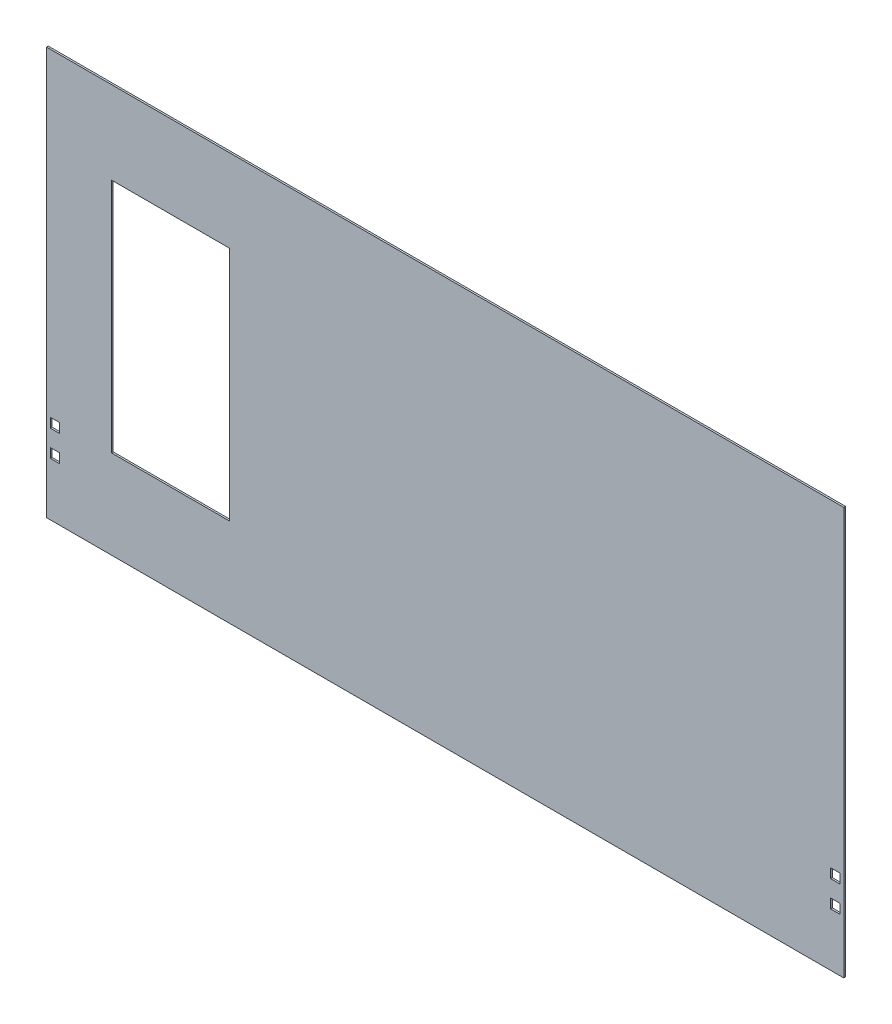
ISO-10303-21;
HEADER;
FILE_DESCRIPTION(('STEP AP214'),'2;1');
FILE_NAME('part.step','',(''),(''),'','','');
FILE_SCHEMA(('AUTOMOTIVE_DESIGN { 1 0 10303 214 1 1 1 1 }'));
ENDSEC;
DATA;
#1=APPLICATION_CONTEXT('core data for automotive mechanical design processes');
#2=APPLICATION_PROTOCOL_DEFINITION('international standard','automotive_design',2000,#1);
#3=PRODUCT_CONTEXT('',#1,'mechanical');
#4=PRODUCT('Part','Part','',(#3));
#5=PRODUCT_RELATED_PRODUCT_CATEGORY('part','',(#4));
#6=PRODUCT_DEFINITION_FORMATION('','',#4);
#7=PRODUCT_DEFINITION_CONTEXT('part definition',#1,'design');
#8=PRODUCT_DEFINITION('design','',#6,#7);
#9=PRODUCT_DEFINITION_SHAPE('','',#8);
#10=(LENGTH_UNIT() NAMED_UNIT(*) SI_UNIT(.MILLI.,.METRE.));
#11=(NAMED_UNIT(*) PLANE_ANGLE_UNIT() SI_UNIT($,.RADIAN.));
#12=(NAMED_UNIT(*) SI_UNIT($,.STERADIAN.) SOLID_ANGLE_UNIT());
#13=UNCERTAINTY_MEASURE_WITH_UNIT(LENGTH_MEASURE(1.E-05),#10,'distance_accuracy_value','');
#14=(GEOMETRIC_REPRESENTATION_CONTEXT(3) GLOBAL_UNCERTAINTY_ASSIGNED_CONTEXT((#13)) GLOBAL_UNIT_ASSIGNED_CONTEXT((#10,
#11,#12)) REPRESENTATION_CONTEXT('',''));
#15=CARTESIAN_POINT('',(0.,0.,0.));
#16=DIRECTION('',(0.,0.,1.));
#17=DIRECTION('',(1.,0.,0.));
#18=AXIS2_PLACEMENT_3D('',#15,#16,#17);
#19=CARTESIAN_POINT('',(0.,0.,-3.));
#20=DIRECTION('',(0.,0.,-1.));
#21=DIRECTION('',(-1.,0.,0.));
#22=AXIS2_PLACEMENT_3D('',#19,#20,#21);
#23=PLANE('',#22);
#24=DIRECTION('',(0.,-1.,0.));
#25=VECTOR('',#24,1.);
#26=CARTESIAN_POINT('',(-565.000000000001,260.,-3.));
#27=LINE('',#26,#25);
#28=CARTESIAN_POINT('',(-565.000000000001,260.,-3.));
#29=VERTEX_POINT('',#28);
#30=CARTESIAN_POINT('',(-565.000000000001,-140.,-3.));
#31=VERTEX_POINT('',#30);
#32=EDGE_CURVE('E398',#29,#31,#27,.T.);
#33=ORIENTED_EDGE('',*,*,#32,.T.);
#34=DIRECTION('',(1.,0.,0.));
#35=VECTOR('',#34,1.);
#36=CARTESIAN_POINT('',(-565.000000000001,-140.,-3.));
#37=LINE('',#36,#35);
#38=CARTESIAN_POINT('',(-365.000000000001,-140.,-3.));
#39=VERTEX_POINT('',#38);
#40=EDGE_CURVE('E540',#31,#39,#37,.T.);
#41=ORIENTED_EDGE('',*,*,#40,.T.);
#42=DIRECTION('',(0.,1.,0.));
#43=VECTOR('',#42,1.);
#44=CARTESIAN_POINT('',(-365.000000000001,260.,-3.));
#45=LINE('',#44,#43);
#46=CARTESIAN_POINT('',(-365.000000000001,260.,-3.));
#47=VERTEX_POINT('',#46);
#48=EDGE_CURVE('E502',#39,#47,#45,.T.);
#49=ORIENTED_EDGE('',*,*,#48,.T.);
#50=DIRECTION('',(-1.,0.,0.));
#51=VECTOR('',#50,1.);
#52=CARTESIAN_POINT('',(-565.000000000001,260.,-3.));
#53=LINE('',#52,#51);
#54=EDGE_CURVE('E630',#47,#29,#53,.T.);
#55=ORIENTED_EDGE('',*,*,#54,.T.);
#56=EDGE_LOOP('',(#33,#41,#49,#55));
#57=FACE_BOUND('',#56,.T.);
#58=DIRECTION('',(-1.,0.,0.));
#59=VECTOR('',#58,1.);
#60=CARTESIAN_POINT('',(-675.,-290.,-3.));
#61=LINE('',#60,#59);
#62=CARTESIAN_POINT('',(675.,-290.,-3.));
#63=VERTEX_POINT('',#62);
#64=CARTESIAN_POINT('',(-675.,-290.,-3.));
#65=VERTEX_POINT('',#64);
#66=EDGE_CURVE('E380',#63,#65,#61,.T.);
#67=ORIENTED_EDGE('',*,*,#66,.T.);
#68=DIRECTION('',(0.,-1.,0.));
#69=VECTOR('',#68,1.);
#70=CARTESIAN_POINT('',(-675.,-400.,-3.));
#71=LINE('',#70,#69);
#72=CARTESIAN_POINT('',(-675.,400.,-3.));
#73=VERTEX_POINT('',#72);
#74=EDGE_CURVE('E475',#73,#65,#71,.T.);
#75=ORIENTED_EDGE('',*,*,#74,.F.);
#76=DIRECTION('',(-1.,0.,0.));
#77=VECTOR('',#76,1.);
#78=CARTESIAN_POINT('',(-675.,400.,-3.));
#79=LINE('',#78,#77);
#80=CARTESIAN_POINT('',(675.,400.,-3.));
#81=VERTEX_POINT('',#80);
#82=EDGE_CURVE('E477',#81,#73,#79,.T.);
#83=ORIENTED_EDGE('',*,*,#82,.F.);
#84=DIRECTION('',(0.,1.,0.));
#85=VECTOR('',#84,1.);
#86=CARTESIAN_POINT('',(675.,-400.,-3.));
#87=LINE('',#86,#85);
#88=EDGE_CURVE('E384',#63,#81,#87,.T.);
#89=ORIENTED_EDGE('',*,*,#88,.F.);
#90=EDGE_LOOP('',(#67,#75,#83,#89));
#91=FACE_BOUND('',#90,.T.);
#92=DIRECTION('',(0.,-1.,0.));
#93=VECTOR('',#92,1.);
#94=CARTESIAN_POINT('',(668.5,-139.5,-3.));
#95=LINE('',#94,#93);
#96=CARTESIAN_POINT('',(668.5,-139.5,-3.));
#97=VERTEX_POINT('',#96);
#98=CARTESIAN_POINT('',(668.5,-155.5,-3.));
#99=VERTEX_POINT('',#98);
#100=EDGE_CURVE('E559',#97,#99,#95,.T.);
#101=ORIENTED_EDGE('',*,*,#100,.F.);
#102=DIRECTION('',(1.,0.,0.));
#103=VECTOR('',#102,1.);
#104=CARTESIAN_POINT('',(652.5,-139.5,-3.));
#105=LINE('',#104,#103);
#106=CARTESIAN_POINT('',(652.5,-139.5,-3.));
#107=VERTEX_POINT('',#106);
#108=EDGE_CURVE('E639',#107,#97,#105,.T.);
#109=ORIENTED_EDGE('',*,*,#108,.F.);
#110=DIRECTION('',(0.,1.,0.));
#111=VECTOR('',#110,1.);
#112=CARTESIAN_POINT('',(652.5,-155.5,-3.));
#113=LINE('',#112,#111);
#114=CARTESIAN_POINT('',(652.5,-155.5,-3.));
#115=VERTEX_POINT('',#114);
#116=EDGE_CURVE('E406',#115,#107,#113,.T.);
#117=ORIENTED_EDGE('',*,*,#116,.F.);
#118=DIRECTION('',(-1.,0.,0.));
#119=VECTOR('',#118,1.);
#120=CARTESIAN_POINT('',(668.5,-155.5,-3.));
#121=LINE('',#120,#119);
#122=EDGE_CURVE('E515',#99,#115,#121,.T.);
#123=ORIENTED_EDGE('',*,*,#122,.F.);
#124=EDGE_LOOP('',(#101,#109,#117,#123));
#125=FACE_BOUND('',#124,.T.);
#126=DIRECTION('',(0.,-1.,0.));
#127=VECTOR('',#126,1.);
#128=CARTESIAN_POINT('',(668.5,-183.850348269495,-3.));
#129=LINE('',#128,#127);
#130=CARTESIAN_POINT('',(668.5,-183.850348269495,-3.));
#131=VERTEX_POINT('',#130);
#132=CARTESIAN_POINT('',(668.5,-199.850348269495,-3.));
#133=VERTEX_POINT('',#132);
#134=EDGE_CURVE('E503',#131,#133,#129,.T.);
#135=ORIENTED_EDGE('',*,*,#134,.F.);
#136=DIRECTION('',(1.,0.,0.));
#137=VECTOR('',#136,1.);
#138=CARTESIAN_POINT('',(652.5,-183.850348269495,-3.));
#139=LINE('',#138,#137);
#140=CARTESIAN_POINT('',(652.5,-183.850348269495,-3.));
#141=VERTEX_POINT('',#140);
#142=EDGE_CURVE('E506',#141,#131,#139,.T.);
#143=ORIENTED_EDGE('',*,*,#142,.F.);
#144=DIRECTION('',(0.,1.,0.));
#145=VECTOR('',#144,1.);
#146=CARTESIAN_POINT('',(652.5,-199.850348269495,-3.));
#147=LINE('',#146,#145);
#148=CARTESIAN_POINT('',(652.5,-199.850348269495,-3.));
#149=VERTEX_POINT('',#148);
#150=EDGE_CURVE('E309',#149,#141,#147,.T.);
#151=ORIENTED_EDGE('',*,*,#150,.F.);
#152=DIRECTION('',(-1.,0.,0.));
#153=VECTOR('',#152,1.);
#154=CARTESIAN_POINT('',(668.5,-199.850348269495,-3.));
#155=LINE('',#154,#153);
#156=EDGE_CURVE('E497',#133,#149,#155,.T.);
#157=ORIENTED_EDGE('',*,*,#156,.F.);
#158=EDGE_LOOP('',(#135,#143,#151,#157));
#159=FACE_BOUND('',#158,.T.);
#160=DIRECTION('',(0.,1.,0.));
#161=VECTOR('',#160,1.);
#162=CARTESIAN_POINT('',(-652.5,-155.5,-3.));
#163=LINE('',#162,#161);
#164=CARTESIAN_POINT('',(-652.5,-155.5,-3.));
#165=VERTEX_POINT('',#164);
#166=CARTESIAN_POINT('',(-652.5,-139.5,-3.));
#167=VERTEX_POINT('',#166);
#168=EDGE_CURVE('E250',#165,#167,#163,.T.);
#169=ORIENTED_EDGE('',*,*,#168,.T.);
#170=DIRECTION('',(-1.,0.,0.));
#171=VECTOR('',#170,1.);
#172=CARTESIAN_POINT('',(-652.5,-139.5,-3.));
#173=LINE('',#172,#171);
#174=CARTESIAN_POINT('',(-668.5,-139.5,-3.));
#175=VERTEX_POINT('',#174);
#176=EDGE_CURVE('E62',#167,#175,#173,.T.);
#177=ORIENTED_EDGE('',*,*,#176,.T.);
#178=DIRECTION('',(0.,-1.,0.));
#179=VECTOR('',#178,1.);
#180=CARTESIAN_POINT('',(-668.5,-139.5,-3.));
#181=LINE('',#180,#179);
#182=CARTESIAN_POINT('',(-668.5,-155.5,-3.));
#183=VERTEX_POINT('',#182);
#184=EDGE_CURVE('E290',#175,#183,#181,.T.);
#185=ORIENTED_EDGE('',*,*,#184,.T.);
#186=DIRECTION('',(1.,0.,0.));
#187=VECTOR('',#186,1.);
#188=CARTESIAN_POINT('',(-668.5,-155.5,-3.));
#189=LINE('',#188,#187);
#190=EDGE_CURVE('E243',#183,#165,#189,.T.);
#191=ORIENTED_EDGE('',*,*,#190,.T.);
#192=EDGE_LOOP('',(#169,#177,#185,#191));
#193=FACE_BOUND('',#192,.T.);
#194=DIRECTION('',(0.,1.,0.));
#195=VECTOR('',#194,1.);
#196=CARTESIAN_POINT('',(-652.5,-199.850348269495,-3.));
#197=LINE('',#196,#195);
#198=CARTESIAN_POINT('',(-652.5,-199.850348269495,-3.));
#199=VERTEX_POINT('',#198);
#200=CARTESIAN_POINT('',(-652.5,-183.850348269495,-3.));
#201=VERTEX_POINT('',#200);
#202=EDGE_CURVE('E202',#199,#201,#197,.T.);
#203=ORIENTED_EDGE('',*,*,#202,.T.);
#204=DIRECTION('',(-1.,0.,0.));
#205=VECTOR('',#204,1.);
#206=CARTESIAN_POINT('',(-652.5,-183.850348269495,-3.));
#207=LINE('',#206,#205);
#208=CARTESIAN_POINT('',(-668.5,-183.850348269495,-3.));
#209=VERTEX_POINT('',#208);
#210=EDGE_CURVE('E54',#201,#209,#207,.T.);
#211=ORIENTED_EDGE('',*,*,#210,.T.);
#212=DIRECTION('',(0.,-1.,0.));
#213=VECTOR('',#212,1.);
#214=CARTESIAN_POINT('',(-668.5,-183.850348269495,-3.));
#215=LINE('',#214,#213);
#216=CARTESIAN_POINT('',(-668.5,-199.850348269495,-3.));
#217=VERTEX_POINT('',#216);
#218=EDGE_CURVE('E222',#209,#217,#215,.T.);
#219=ORIENTED_EDGE('',*,*,#218,.T.);
#220=DIRECTION('',(1.,0.,0.));
#221=VECTOR('',#220,1.);
#222=CARTESIAN_POINT('',(-668.5,-199.850348269495,-3.));
#223=LINE('',#222,#221);
#224=EDGE_CURVE('E215',#217,#199,#223,.T.);
#225=ORIENTED_EDGE('',*,*,#224,.T.);
#226=EDGE_LOOP('',(#203,#211,#219,#225));
#227=FACE_BOUND('',#226,.T.);
#228=ADVANCED_FACE('F39',(#57,#91,#125,#159,#193,#227),#23,.T.);
#229=CARTESIAN_POINT('',(0.,0.,0.));
#230=DIRECTION('',(0.,0.,-1.));
#231=DIRECTION('',(-1.,0.,0.));
#232=AXIS2_PLACEMENT_3D('',#229,#230,#231);
#233=PLANE('',#232);
#234=CARTESIAN_POINT('',(-652.5,-139.5,0.));
#235=CARTESIAN_POINT('',(-668.5,-139.5,0.));
#236=B_SPLINE_CURVE_WITH_KNOTS('',1,(#234,#235),.UNSPECIFIED.,.F.,.F.,(2,2),(0.,0.25),.UNSPECIFIED.);
#237=CARTESIAN_POINT('',(-652.5,-139.5,0.));
#238=VERTEX_POINT('',#237);
#239=CARTESIAN_POINT('',(-668.5,-139.5,0.));
#240=VERTEX_POINT('',#239);
#241=EDGE_CURVE('E275',#238,#240,#236,.T.);
#242=ORIENTED_EDGE('',*,*,#241,.F.);
#243=CARTESIAN_POINT('',(-652.5,-155.5,0.));
#244=CARTESIAN_POINT('',(-652.5,-139.5,0.));
#245=B_SPLINE_CURVE_WITH_KNOTS('',1,(#243,#244),.UNSPECIFIED.,.F.,.F.,(2,2),(0.75,1.),.UNSPECIFIED.);
#246=CARTESIAN_POINT('',(-652.5,-155.5,0.));
#247=VERTEX_POINT('',#246);
#248=EDGE_CURVE('E244',#247,#238,#245,.T.);
#249=ORIENTED_EDGE('',*,*,#248,.F.);
#250=CARTESIAN_POINT('',(-668.5,-155.5,0.));
#251=CARTESIAN_POINT('',(-652.5,-155.5,0.));
#252=B_SPLINE_CURVE_WITH_KNOTS('',1,(#250,#251),.UNSPECIFIED.,.F.,.F.,(2,2),(0.5,0.75),.UNSPECIFIED.);
#253=CARTESIAN_POINT('',(-668.5,-155.5,0.));
#254=VERTEX_POINT('',#253);
#255=EDGE_CURVE('E252',#254,#247,#252,.T.);
#256=ORIENTED_EDGE('',*,*,#255,.F.);
#257=CARTESIAN_POINT('',(-668.5,-139.5,0.));
#258=CARTESIAN_POINT('',(-668.5,-155.5,0.));
#259=B_SPLINE_CURVE_WITH_KNOTS('',1,(#257,#258),.UNSPECIFIED.,.F.,.F.,(2,2),(0.25,0.5),.UNSPECIFIED.);
#260=EDGE_CURVE('E268',#240,#254,#259,.T.);
#261=ORIENTED_EDGE('',*,*,#260,.F.);
#262=EDGE_LOOP('',(#242,#249,#256,#261));
#263=FACE_BOUND('',#262,.T.);
#264=CARTESIAN_POINT('',(652.5,-139.5,0.));
#265=CARTESIAN_POINT('',(668.5,-139.5,0.));
#266=B_SPLINE_CURVE_WITH_KNOTS('',1,(#264,#265),.UNSPECIFIED.,.F.,.F.,(2,2),(0.,0.25),.UNSPECIFIED.);
#267=CARTESIAN_POINT('',(652.5,-139.5,0.));
#268=VERTEX_POINT('',#267);
#269=CARTESIAN_POINT('',(668.5,-139.5,0.));
#270=VERTEX_POINT('',#269);
#271=EDGE_CURVE('E226',#268,#270,#266,.T.);
#272=ORIENTED_EDGE('',*,*,#271,.T.);
#273=CARTESIAN_POINT('',(668.5,-139.5,0.));
#274=CARTESIAN_POINT('',(668.5,-155.5,0.));
#275=B_SPLINE_CURVE_WITH_KNOTS('',1,(#273,#274),.UNSPECIFIED.,.F.,.F.,(2,2),(0.25,0.5),.UNSPECIFIED.);
#276=CARTESIAN_POINT('',(668.5,-155.5,0.));
#277=VERTEX_POINT('',#276);
#278=EDGE_CURVE('E414',#270,#277,#275,.T.);
#279=ORIENTED_EDGE('',*,*,#278,.T.);
#280=CARTESIAN_POINT('',(668.5,-155.5,0.));
#281=CARTESIAN_POINT('',(652.5,-155.5,0.));
#282=B_SPLINE_CURVE_WITH_KNOTS('',1,(#280,#281),.UNSPECIFIED.,.F.,.F.,(2,2),(0.5,0.75),.UNSPECIFIED.);
#283=CARTESIAN_POINT('',(652.5,-155.5,0.));
#284=VERTEX_POINT('',#283);
#285=EDGE_CURVE('E409',#277,#284,#282,.T.);
#286=ORIENTED_EDGE('',*,*,#285,.T.);
#287=CARTESIAN_POINT('',(652.5,-155.5,0.));
#288=CARTESIAN_POINT('',(652.5,-139.5,0.));
#289=B_SPLINE_CURVE_WITH_KNOTS('',1,(#287,#288),.UNSPECIFIED.,.F.,.F.,(2,2),(0.75,1.),.UNSPECIFIED.);
#290=EDGE_CURVE('E403',#284,#268,#289,.T.);
#291=ORIENTED_EDGE('',*,*,#290,.T.);
#292=EDGE_LOOP('',(#272,#279,#286,#291));
#293=FACE_BOUND('',#292,.T.);
#294=DIRECTION('',(1.,0.,0.));
#295=VECTOR('',#294,1.);
#296=CARTESIAN_POINT('',(-565.000000000001,-140.,0.));
#297=LINE('',#296,#295);
#298=CARTESIAN_POINT('',(-565.000000000001,-140.,0.));
#299=VERTEX_POINT('',#298);
#300=CARTESIAN_POINT('',(-365.000000000001,-140.,0.));
#301=VERTEX_POINT('',#300);
#302=EDGE_CURVE('E390',#299,#301,#297,.T.);
#303=ORIENTED_EDGE('',*,*,#302,.F.);
#304=DIRECTION('',(0.,-1.,0.));
#305=VECTOR('',#304,1.);
#306=CARTESIAN_POINT('',(-565.000000000001,260.,0.));
#307=LINE('',#306,#305);
#308=CARTESIAN_POINT('',(-565.000000000001,260.,0.));
#309=VERTEX_POINT('',#308);
#310=EDGE_CURVE('E396',#309,#299,#307,.T.);
#311=ORIENTED_EDGE('',*,*,#310,.F.);
#312=DIRECTION('',(-1.,0.,0.));
#313=VECTOR('',#312,1.);
#314=CARTESIAN_POINT('',(-565.000000000001,260.,0.));
#315=LINE('',#314,#313);
#316=CARTESIAN_POINT('',(-365.000000000001,260.,0.));
#317=VERTEX_POINT('',#316);
#318=EDGE_CURVE('E389',#317,#309,#315,.T.);
#319=ORIENTED_EDGE('',*,*,#318,.F.);
#320=DIRECTION('',(0.,1.,0.));
#321=VECTOR('',#320,1.);
#322=CARTESIAN_POINT('',(-365.000000000001,260.,0.));
#323=LINE('',#322,#321);
#324=EDGE_CURVE('E386',#301,#317,#323,.T.);
#325=ORIENTED_EDGE('',*,*,#324,.F.);
#326=EDGE_LOOP('',(#303,#311,#319,#325));
#327=FACE_BOUND('',#326,.T.);
#328=DIRECTION('',(0.,-1.,0.));
#329=VECTOR('',#328,1.);
#330=CARTESIAN_POINT('',(-675.,-400.,0.));
#331=LINE('',#330,#329);
#332=CARTESIAN_POINT('',(-675.,400.,0.));
#333=VERTEX_POINT('',#332);
#334=CARTESIAN_POINT('',(-675.,-290.,0.));
#335=VERTEX_POINT('',#334);
#336=EDGE_CURVE('E371',#333,#335,#331,.T.);
#337=ORIENTED_EDGE('',*,*,#336,.T.);
#338=DIRECTION('',(-1.,0.,0.));
#339=VECTOR('',#338,1.);
#340=CARTESIAN_POINT('',(-675.,-290.,0.));
#341=LINE('',#340,#339);
#342=CARTESIAN_POINT('',(675.,-290.,0.));
#343=VERTEX_POINT('',#342);
#344=EDGE_CURVE('E377',#343,#335,#341,.T.);
#345=ORIENTED_EDGE('',*,*,#344,.F.);
#346=DIRECTION('',(0.,1.,0.));
#347=VECTOR('',#346,1.);
#348=CARTESIAN_POINT('',(675.,-400.,0.));
#349=LINE('',#348,#347);
#350=CARTESIAN_POINT('',(675.,400.,0.));
#351=VERTEX_POINT('',#350);
#352=EDGE_CURVE('E372',#343,#351,#349,.T.);
#353=ORIENTED_EDGE('',*,*,#352,.T.);
#354=DIRECTION('',(-1.,0.,0.));
#355=VECTOR('',#354,1.);
#356=CARTESIAN_POINT('',(-675.,400.,0.));
#357=LINE('',#356,#355);
#358=EDGE_CURVE('E368',#351,#333,#357,.T.);
#359=ORIENTED_EDGE('',*,*,#358,.T.);
#360=EDGE_LOOP('',(#337,#345,#353,#359));
#361=FACE_BOUND('',#360,.T.);
#362=CARTESIAN_POINT('',(652.5,-183.850348269495,0.));
#363=CARTESIAN_POINT('',(668.5,-183.850348269495,0.));
#364=B_SPLINE_CURVE_WITH_KNOTS('',1,(#362,#363),.UNSPECIFIED.,.F.,.F.,(2,2),(0.,0.25),.UNSPECIFIED.);
#365=CARTESIAN_POINT('',(652.5,-183.850348269495,0.));
#366=VERTEX_POINT('',#365);
#367=CARTESIAN_POINT('',(668.5,-183.850348269495,0.));
#368=VERTEX_POINT('',#367);
#369=EDGE_CURVE('E363',#366,#368,#364,.T.);
#370=ORIENTED_EDGE('',*,*,#369,.T.);
#371=CARTESIAN_POINT('',(668.5,-183.850348269495,0.));
#372=CARTESIAN_POINT('',(668.5,-199.850348269495,0.));
#373=B_SPLINE_CURVE_WITH_KNOTS('',1,(#371,#372),.UNSPECIFIED.,.F.,.F.,(2,2),(0.25,0.5),.UNSPECIFIED.);
#374=CARTESIAN_POINT('',(668.5,-199.850348269495,0.));
#375=VERTEX_POINT('',#374);
#376=EDGE_CURVE('E359',#368,#375,#373,.T.);
#377=ORIENTED_EDGE('',*,*,#376,.T.);
#378=CARTESIAN_POINT('',(668.5,-199.850348269495,0.));
#379=CARTESIAN_POINT('',(652.5,-199.850348269495,0.));
#380=B_SPLINE_CURVE_WITH_KNOTS('',1,(#378,#379),.UNSPECIFIED.,.F.,.F.,(2,2),(0.5,0.75),.UNSPECIFIED.);
#381=CARTESIAN_POINT('',(652.5,-199.850348269495,0.));
#382=VERTEX_POINT('',#381);
#383=EDGE_CURVE('E311',#375,#382,#380,.T.);
#384=ORIENTED_EDGE('',*,*,#383,.T.);
#385=CARTESIAN_POINT('',(652.5,-199.850348269495,0.));
#386=CARTESIAN_POINT('',(652.5,-183.850348269495,0.));
#387=B_SPLINE_CURVE_WITH_KNOTS('',1,(#385,#386),.UNSPECIFIED.,.F.,.F.,(2,2),(0.75,1.),.UNSPECIFIED.);
#388=EDGE_CURVE('E302',#382,#366,#387,.T.);
#389=ORIENTED_EDGE('',*,*,#388,.T.);
#390=EDGE_LOOP('',(#370,#377,#384,#389));
#391=FACE_BOUND('',#390,.T.);
#392=CARTESIAN_POINT('',(-652.5,-183.850348269495,0.));
#393=CARTESIAN_POINT('',(-668.5,-183.850348269495,0.));
#394=B_SPLINE_CURVE_WITH_KNOTS('',1,(#392,#393),.UNSPECIFIED.,.F.,.F.,(2,2),(0.,0.25),.UNSPECIFIED.);
#395=CARTESIAN_POINT('',(-652.5,-183.850348269495,0.));
#396=VERTEX_POINT('',#395);
#397=CARTESIAN_POINT('',(-668.5,-183.850348269495,0.));
#398=VERTEX_POINT('',#397);
#399=EDGE_CURVE('E230',#396,#398,#394,.T.);
#400=ORIENTED_EDGE('',*,*,#399,.F.);
#401=CARTESIAN_POINT('',(-652.5,-199.850348269495,0.));
#402=CARTESIAN_POINT('',(-652.5,-183.850348269495,0.));
#403=B_SPLINE_CURVE_WITH_KNOTS('',1,(#401,#402),.UNSPECIFIED.,.F.,.F.,(2,2),(0.75,1.),.UNSPECIFIED.);
#404=CARTESIAN_POINT('',(-652.5,-199.850348269495,0.));
#405=VERTEX_POINT('',#404);
#406=EDGE_CURVE('E210',#405,#396,#403,.T.);
#407=ORIENTED_EDGE('',*,*,#406,.F.);
#408=CARTESIAN_POINT('',(-668.5,-199.850348269495,0.));
#409=CARTESIAN_POINT('',(-652.5,-199.850348269495,0.));
#410=B_SPLINE_CURVE_WITH_KNOTS('',1,(#408,#409),.UNSPECIFIED.,.F.,.F.,(2,2),(0.5,0.75),.UNSPECIFIED.);
#411=CARTESIAN_POINT('',(-668.5,-199.850348269495,0.));
#412=VERTEX_POINT('',#411);
#413=EDGE_CURVE('E218',#412,#405,#410,.T.);
#414=ORIENTED_EDGE('',*,*,#413,.F.);
#415=CARTESIAN_POINT('',(-668.5,-183.850348269495,0.));
#416=CARTESIAN_POINT('',(-668.5,-199.850348269495,0.));
#417=B_SPLINE_CURVE_WITH_KNOTS('',1,(#415,#416),.UNSPECIFIED.,.F.,.F.,(2,2),(0.25,0.5),.UNSPECIFIED.);
#418=EDGE_CURVE('E239',#398,#412,#417,.T.);
#419=ORIENTED_EDGE('',*,*,#418,.F.);
#420=EDGE_LOOP('',(#400,#407,#414,#419));
#421=FACE_BOUND('',#420,.T.);
#422=ADVANCED_FACE('F352',(#263,#293,#327,#361,#391,#421),#233,.F.);
#423=CARTESIAN_POINT('',(675.,-400.,-3.));
#424=DIRECTION('',(1.,0.,0.));
#425=DIRECTION('',(0.,0.,-1.));
#426=AXIS2_PLACEMENT_3D('',#423,#424,#425);
#427=PLANE('',#426);
#428=DIRECTION('',(0.,0.,1.));
#429=VECTOR('',#428,1.);
#430=CARTESIAN_POINT('',(675.,-290.,-3.001));
#431=LINE('',#430,#429);
#432=EDGE_CURVE('E379',#63,#343,#431,.T.);
#433=ORIENTED_EDGE('',*,*,#432,.F.);
#434=ORIENTED_EDGE('',*,*,#88,.T.);
#435=DIRECTION('',(0.,0.,1.));
#436=VECTOR('',#435,1.);
#437=CARTESIAN_POINT('',(675.,400.,-3.));
#438=LINE('',#437,#436);
#439=EDGE_CURVE('E43',#81,#351,#438,.T.);
#440=ORIENTED_EDGE('',*,*,#439,.T.);
#441=ORIENTED_EDGE('',*,*,#352,.F.);
#442=EDGE_LOOP('',(#433,#434,#440,#441));
#443=FACE_BOUND('',#442,.T.);
#444=ADVANCED_FACE('F41',(#443),#427,.T.);
#445=CARTESIAN_POINT('',(-675.,-400.,-3.));
#446=DIRECTION('',(-1.,0.,0.));
#447=DIRECTION('',(0.,0.,1.));
#448=AXIS2_PLACEMENT_3D('',#445,#446,#447);
#449=PLANE('',#448);
#450=DIRECTION('',(0.,0.,1.));
#451=VECTOR('',#450,1.);
#452=CARTESIAN_POINT('',(-675.,-290.,-3.001));
#453=LINE('',#452,#451);
#454=EDGE_CURVE('E375',#65,#335,#453,.T.);
#455=ORIENTED_EDGE('',*,*,#454,.T.);
#456=ORIENTED_EDGE('',*,*,#336,.F.);
#457=DIRECTION('',(0.,0.,1.));
#458=VECTOR('',#457,1.);
#459=CARTESIAN_POINT('',(-675.,400.,-3.));
#460=LINE('',#459,#458);
#461=EDGE_CURVE('E12',#73,#333,#460,.T.);
#462=ORIENTED_EDGE('',*,*,#461,.F.);
#463=ORIENTED_EDGE('',*,*,#74,.T.);
#464=EDGE_LOOP('',(#455,#456,#462,#463));
#465=FACE_BOUND('',#464,.T.);
#466=ADVANCED_FACE('F451',(#465),#449,.T.);
#467=CARTESIAN_POINT('',(-675.,400.,-3.));
#468=DIRECTION('',(0.,1.,0.));
#469=DIRECTION('',(0.,0.,1.));
#470=AXIS2_PLACEMENT_3D('',#467,#468,#469);
#471=PLANE('',#470);
#472=ORIENTED_EDGE('',*,*,#358,.F.);
#473=ORIENTED_EDGE('',*,*,#439,.F.);
#474=ORIENTED_EDGE('',*,*,#82,.T.);
#475=ORIENTED_EDGE('',*,*,#461,.T.);
#476=EDGE_LOOP('',(#472,#473,#474,#475));
#477=FACE_BOUND('',#476,.T.);
#478=ADVANCED_FACE('F453',(#477),#471,.T.);
#479=CARTESIAN_POINT('',(-675.,-290.,-3.001));
#480=DIRECTION('',(0.,1.,0.));
#481=DIRECTION('',(0.,0.,1.));
#482=AXIS2_PLACEMENT_3D('',#479,#480,#481);
#483=PLANE('',#482);
#484=ORIENTED_EDGE('',*,*,#432,.T.);
#485=ORIENTED_EDGE('',*,*,#344,.T.);
#486=ORIENTED_EDGE('',*,*,#454,.F.);
#487=ORIENTED_EDGE('',*,*,#66,.F.);
#488=EDGE_LOOP('',(#484,#485,#486,#487));
#489=FACE_BOUND('',#488,.T.);
#490=ADVANCED_FACE('F448',(#489),#483,.F.);
#491=CARTESIAN_POINT('',(-565.000000000001,260.,-3.001));
#492=DIRECTION('',(-1.,0.,0.));
#493=DIRECTION('',(0.,0.,1.));
#494=AXIS2_PLACEMENT_3D('',#491,#492,#493);
#495=PLANE('',#494);
#496=DIRECTION('',(0.,0.,1.));
#497=VECTOR('',#496,1.);
#498=CARTESIAN_POINT('',(-565.000000000001,260.,-3.001));
#499=LINE('',#498,#497);
#500=EDGE_CURVE('E538',#29,#309,#499,.T.);
#501=ORIENTED_EDGE('',*,*,#500,.T.);
#502=ORIENTED_EDGE('',*,*,#310,.T.);
#503=DIRECTION('',(0.,0.,1.));
#504=VECTOR('',#503,1.);
#505=CARTESIAN_POINT('',(-565.000000000001,-140.,-3.001));
#506=LINE('',#505,#504);
#507=EDGE_CURVE('E394',#31,#299,#506,.T.);
#508=ORIENTED_EDGE('',*,*,#507,.F.);
#509=ORIENTED_EDGE('',*,*,#32,.F.);
#510=EDGE_LOOP('',(#501,#502,#508,#509));
#511=FACE_BOUND('',#510,.T.);
#512=ADVANCED_FACE('F460',(#511),#495,.F.);
#513=CARTESIAN_POINT('',(-565.000000000001,260.,-3.001));
#514=DIRECTION('',(0.,1.,0.));
#515=DIRECTION('',(0.,0.,1.));
#516=AXIS2_PLACEMENT_3D('',#513,#514,#515);
#517=PLANE('',#516);
#518=DIRECTION('',(0.,0.,1.));
#519=VECTOR('',#518,1.);
#520=CARTESIAN_POINT('',(-365.000000000001,260.,-3.001));
#521=LINE('',#520,#519);
#522=EDGE_CURVE('E541',#47,#317,#521,.T.);
#523=ORIENTED_EDGE('',*,*,#522,.T.);
#524=ORIENTED_EDGE('',*,*,#318,.T.);
#525=ORIENTED_EDGE('',*,*,#500,.F.);
#526=ORIENTED_EDGE('',*,*,#54,.F.);
#527=EDGE_LOOP('',(#523,#524,#525,#526));
#528=FACE_BOUND('',#527,.T.);
#529=ADVANCED_FACE('F605',(#528),#517,.F.);
#530=CARTESIAN_POINT('',(-365.000000000001,260.,-3.001));
#531=DIRECTION('',(1.,0.,0.));
#532=DIRECTION('',(0.,1.,0.));
#533=AXIS2_PLACEMENT_3D('',#530,#531,#532);
#534=PLANE('',#533);
#535=DIRECTION('',(0.,0.,1.));
#536=VECTOR('',#535,1.);
#537=CARTESIAN_POINT('',(-365.000000000001,-140.,-3.001));
#538=LINE('',#537,#536);
#539=EDGE_CURVE('E543',#39,#301,#538,.T.);
#540=ORIENTED_EDGE('',*,*,#539,.T.);
#541=ORIENTED_EDGE('',*,*,#324,.T.);
#542=ORIENTED_EDGE('',*,*,#522,.F.);
#543=ORIENTED_EDGE('',*,*,#48,.F.);
#544=EDGE_LOOP('',(#540,#541,#542,#543));
#545=FACE_BOUND('',#544,.T.);
#546=ADVANCED_FACE('F608',(#545),#534,.F.);
#547=CARTESIAN_POINT('',(-565.000000000001,-140.,-3.001));
#548=DIRECTION('',(0.,-1.,0.));
#549=DIRECTION('',(0.,0.,-1.));
#550=AXIS2_PLACEMENT_3D('',#547,#548,#549);
#551=PLANE('',#550);
#552=ORIENTED_EDGE('',*,*,#507,.T.);
#553=ORIENTED_EDGE('',*,*,#302,.T.);
#554=ORIENTED_EDGE('',*,*,#539,.F.);
#555=ORIENTED_EDGE('',*,*,#40,.F.);
#556=EDGE_LOOP('',(#552,#553,#554,#555));
#557=FACE_BOUND('',#556,.T.);
#558=ADVANCED_FACE('F603',(#557),#551,.F.);
#559=CARTESIAN_POINT('',(652.5,-139.5,-6.));
#560=DIRECTION('',(0.,-1.,0.));
#561=DIRECTION('',(0.,0.,-1.));
#562=AXIS2_PLACEMENT_3D('',#559,#560,#561);
#563=PLANE('',#562);
#564=ORIENTED_EDGE('',*,*,#108,.T.);
#565=DIRECTION('',(0.,0.,1.));
#566=VECTOR('',#565,1.);
#567=CARTESIAN_POINT('',(668.5,-139.5,-6.));
#568=LINE('',#567,#566);
#569=EDGE_CURVE('E417',#97,#270,#568,.T.);
#570=ORIENTED_EDGE('',*,*,#569,.T.);
#571=ORIENTED_EDGE('',*,*,#271,.F.);
#572=DIRECTION('',(0.,0.,1.));
#573=VECTOR('',#572,1.);
#574=CARTESIAN_POINT('',(652.5,-139.5,-6.));
#575=LINE('',#574,#573);
#576=EDGE_CURVE('E223',#107,#268,#575,.T.);
#577=ORIENTED_EDGE('',*,*,#576,.F.);
#578=EDGE_LOOP('',(#564,#570,#571,#577));
#579=FACE_BOUND('',#578,.T.);
#580=ADVANCED_FACE('F599',(#579),#563,.T.);
#581=CARTESIAN_POINT('',(668.5,-139.5,-6.));
#582=DIRECTION('',(-1.,0.,0.));
#583=DIRECTION('',(0.,0.,1.));
#584=AXIS2_PLACEMENT_3D('',#581,#582,#583);
#585=PLANE('',#584);
#586=ORIENTED_EDGE('',*,*,#100,.T.);
#587=DIRECTION('',(0.,0.,1.));
#588=VECTOR('',#587,1.);
#589=CARTESIAN_POINT('',(668.5,-155.5,-6.));
#590=LINE('',#589,#588);
#591=EDGE_CURVE('E412',#99,#277,#590,.T.);
#592=ORIENTED_EDGE('',*,*,#591,.T.);
#593=ORIENTED_EDGE('',*,*,#278,.F.);
#594=ORIENTED_EDGE('',*,*,#569,.F.);
#595=EDGE_LOOP('',(#586,#592,#593,#594));
#596=FACE_BOUND('',#595,.T.);
#597=ADVANCED_FACE('F595',(#596),#585,.T.);
#598=CARTESIAN_POINT('',(668.5,-155.5,-6.));
#599=DIRECTION('',(0.,1.,0.));
#600=DIRECTION('',(0.,0.,1.));
#601=AXIS2_PLACEMENT_3D('',#598,#599,#600);
#602=PLANE('',#601);
#603=ORIENTED_EDGE('',*,*,#122,.T.);
#604=DIRECTION('',(0.,0.,1.));
#605=VECTOR('',#604,1.);
#606=CARTESIAN_POINT('',(652.5,-155.5,-6.));
#607=LINE('',#606,#605);
#608=EDGE_CURVE('E407',#115,#284,#607,.T.);
#609=ORIENTED_EDGE('',*,*,#608,.T.);
#610=ORIENTED_EDGE('',*,*,#285,.F.);
#611=ORIENTED_EDGE('',*,*,#591,.F.);
#612=EDGE_LOOP('',(#603,#609,#610,#611));
#613=FACE_BOUND('',#612,.T.);
#614=ADVANCED_FACE('F591',(#613),#602,.T.);
#615=CARTESIAN_POINT('',(652.5,-155.5,-6.));
#616=DIRECTION('',(1.,0.,0.));
#617=DIRECTION('',(0.,0.,-1.));
#618=AXIS2_PLACEMENT_3D('',#615,#616,#617);
#619=PLANE('',#618);
#620=ORIENTED_EDGE('',*,*,#116,.T.);
#621=ORIENTED_EDGE('',*,*,#576,.T.);
#622=ORIENTED_EDGE('',*,*,#290,.F.);
#623=ORIENTED_EDGE('',*,*,#608,.F.);
#624=EDGE_LOOP('',(#620,#621,#622,#623));
#625=FACE_BOUND('',#624,.T.);
#626=ADVANCED_FACE('F588',(#625),#619,.T.);
#627=CARTESIAN_POINT('',(652.5,-183.850348269495,-6.));
#628=DIRECTION('',(0.,-1.,0.));
#629=DIRECTION('',(0.,0.,-1.));
#630=AXIS2_PLACEMENT_3D('',#627,#628,#629);
#631=PLANE('',#630);
#632=ORIENTED_EDGE('',*,*,#142,.T.);
#633=DIRECTION('',(0.,0.,1.));
#634=VECTOR('',#633,1.);
#635=CARTESIAN_POINT('',(668.5,-183.850348269495,-6.));
#636=LINE('',#635,#634);
#637=EDGE_CURVE('E362',#131,#368,#636,.T.);
#638=ORIENTED_EDGE('',*,*,#637,.T.);
#639=ORIENTED_EDGE('',*,*,#369,.F.);
#640=DIRECTION('',(0.,0.,1.));
#641=VECTOR('',#640,1.);
#642=CARTESIAN_POINT('',(652.5,-183.850348269495,-6.));
#643=LINE('',#642,#641);
#644=EDGE_CURVE('E366',#141,#366,#643,.T.);
#645=ORIENTED_EDGE('',*,*,#644,.F.);
#646=EDGE_LOOP('',(#632,#638,#639,#645));
#647=FACE_BOUND('',#646,.T.);
#648=ADVANCED_FACE('F569',(#647),#631,.T.);
#649=CARTESIAN_POINT('',(668.5,-183.850348269495,-6.));
#650=DIRECTION('',(-1.,0.,0.));
#651=DIRECTION('',(0.,0.,1.));
#652=AXIS2_PLACEMENT_3D('',#649,#650,#651);
#653=PLANE('',#652);
#654=ORIENTED_EDGE('',*,*,#134,.T.);
#655=DIRECTION('',(0.,0.,1.));
#656=VECTOR('',#655,1.);
#657=CARTESIAN_POINT('',(668.5,-199.850348269495,-6.));
#658=LINE('',#657,#656);
#659=EDGE_CURVE('E358',#133,#375,#658,.T.);
#660=ORIENTED_EDGE('',*,*,#659,.T.);
#661=ORIENTED_EDGE('',*,*,#376,.F.);
#662=ORIENTED_EDGE('',*,*,#637,.F.);
#663=EDGE_LOOP('',(#654,#660,#661,#662));
#664=FACE_BOUND('',#663,.T.);
#665=ADVANCED_FACE('F565',(#664),#653,.T.);
#666=CARTESIAN_POINT('',(668.5,-199.850348269495,-6.));
#667=DIRECTION('',(0.,1.,0.));
#668=DIRECTION('',(0.,0.,1.));
#669=AXIS2_PLACEMENT_3D('',#666,#667,#668);
#670=PLANE('',#669);
#671=ORIENTED_EDGE('',*,*,#156,.T.);
#672=DIRECTION('',(0.,0.,1.));
#673=VECTOR('',#672,1.);
#674=CARTESIAN_POINT('',(652.5,-199.850348269495,-6.));
#675=LINE('',#674,#673);
#676=EDGE_CURVE('E310',#149,#382,#675,.T.);
#677=ORIENTED_EDGE('',*,*,#676,.T.);
#678=ORIENTED_EDGE('',*,*,#383,.F.);
#679=ORIENTED_EDGE('',*,*,#659,.F.);
#680=EDGE_LOOP('',(#671,#677,#678,#679));
#681=FACE_BOUND('',#680,.T.);
#682=ADVANCED_FACE('F575',(#681),#670,.T.);
#683=CARTESIAN_POINT('',(652.5,-199.850348269495,-6.));
#684=DIRECTION('',(1.,0.,0.));
#685=DIRECTION('',(0.,0.,-1.));
#686=AXIS2_PLACEMENT_3D('',#683,#684,#685);
#687=PLANE('',#686);
#688=ORIENTED_EDGE('',*,*,#150,.T.);
#689=ORIENTED_EDGE('',*,*,#644,.T.);
#690=ORIENTED_EDGE('',*,*,#388,.F.);
#691=ORIENTED_EDGE('',*,*,#676,.F.);
#692=EDGE_LOOP('',(#688,#689,#690,#691));
#693=FACE_BOUND('',#692,.T.);
#694=ADVANCED_FACE('F573',(#693),#687,.T.);
#695=CARTESIAN_POINT('',(-652.5,-139.5,-6.));
#696=DIRECTION('',(0.,-1.,0.));
#697=DIRECTION('',(0.,0.,-1.));
#698=AXIS2_PLACEMENT_3D('',#695,#696,#697);
#699=PLANE('',#698);
#700=ORIENTED_EDGE('',*,*,#176,.F.);
#701=DIRECTION('',(0.,0.,1.));
#702=VECTOR('',#701,1.);
#703=CARTESIAN_POINT('',(-652.5,-139.5,-6.));
#704=LINE('',#703,#702);
#705=EDGE_CURVE('E284',#167,#238,#704,.T.);
#706=ORIENTED_EDGE('',*,*,#705,.T.);
#707=ORIENTED_EDGE('',*,*,#241,.T.);
#708=DIRECTION('',(0.,0.,1.));
#709=VECTOR('',#708,1.);
#710=CARTESIAN_POINT('',(-668.5,-139.5,-6.));
#711=LINE('',#710,#709);
#712=EDGE_CURVE('E274',#175,#240,#711,.T.);
#713=ORIENTED_EDGE('',*,*,#712,.F.);
#714=EDGE_LOOP('',(#700,#706,#707,#713));
#715=FACE_BOUND('',#714,.T.);
#716=ADVANCED_FACE('F434',(#715),#699,.T.);
#717=CARTESIAN_POINT('',(-668.5,-139.5,-6.));
#718=DIRECTION('',(1.,0.,0.));
#719=DIRECTION('',(0.,0.,1.));
#720=AXIS2_PLACEMENT_3D('',#717,#718,#719);
#721=PLANE('',#720);
#722=ORIENTED_EDGE('',*,*,#184,.F.);
#723=ORIENTED_EDGE('',*,*,#712,.T.);
#724=ORIENTED_EDGE('',*,*,#260,.T.);
#725=DIRECTION('',(0.,0.,1.));
#726=VECTOR('',#725,1.);
#727=CARTESIAN_POINT('',(-668.5,-155.5,-6.));
#728=LINE('',#727,#726);
#729=EDGE_CURVE('E273',#183,#254,#728,.T.);
#730=ORIENTED_EDGE('',*,*,#729,.F.);
#731=EDGE_LOOP('',(#722,#723,#724,#730));
#732=FACE_BOUND('',#731,.T.);
#733=ADVANCED_FACE('F436',(#732),#721,.T.);
#734=CARTESIAN_POINT('',(-668.5,-155.5,-6.));
#735=DIRECTION('',(0.,1.,0.));
#736=DIRECTION('',(0.,0.,1.));
#737=AXIS2_PLACEMENT_3D('',#734,#735,#736);
#738=PLANE('',#737);
#739=ORIENTED_EDGE('',*,*,#190,.F.);
#740=ORIENTED_EDGE('',*,*,#729,.T.);
#741=ORIENTED_EDGE('',*,*,#255,.T.);
#742=DIRECTION('',(0.,0.,1.));
#743=VECTOR('',#742,1.);
#744=CARTESIAN_POINT('',(-652.5,-155.5,-6.));
#745=LINE('',#744,#743);
#746=EDGE_CURVE('E251',#165,#247,#745,.T.);
#747=ORIENTED_EDGE('',*,*,#746,.F.);
#748=EDGE_LOOP('',(#739,#740,#741,#747));
#749=FACE_BOUND('',#748,.T.);
#750=ADVANCED_FACE('F426',(#749),#738,.T.);
#751=CARTESIAN_POINT('',(-652.5,-155.5,-6.));
#752=DIRECTION('',(-1.,0.,0.));
#753=DIRECTION('',(0.,0.,-1.));
#754=AXIS2_PLACEMENT_3D('',#751,#752,#753);
#755=PLANE('',#754);
#756=ORIENTED_EDGE('',*,*,#168,.F.);
#757=ORIENTED_EDGE('',*,*,#746,.T.);
#758=ORIENTED_EDGE('',*,*,#248,.T.);
#759=ORIENTED_EDGE('',*,*,#705,.F.);
#760=EDGE_LOOP('',(#756,#757,#758,#759));
#761=FACE_BOUND('',#760,.T.);
#762=ADVANCED_FACE('F433',(#761),#755,.T.);
#763=CARTESIAN_POINT('',(-652.5,-183.850348269495,-6.));
#764=DIRECTION('',(0.,-1.,0.));
#765=DIRECTION('',(0.,0.,-1.));
#766=AXIS2_PLACEMENT_3D('',#763,#764,#765);
#767=PLANE('',#766);
#768=ORIENTED_EDGE('',*,*,#210,.F.);
#769=DIRECTION('',(0.,0.,1.));
#770=VECTOR('',#769,1.);
#771=CARTESIAN_POINT('',(-652.5,-183.850348269495,-6.));
#772=LINE('',#771,#770);
#773=EDGE_CURVE('E207',#201,#396,#772,.T.);
#774=ORIENTED_EDGE('',*,*,#773,.T.);
#775=ORIENTED_EDGE('',*,*,#399,.T.);
#776=DIRECTION('',(0.,0.,1.));
#777=VECTOR('',#776,1.);
#778=CARTESIAN_POINT('',(-668.5,-183.850348269495,-6.));
#779=LINE('',#778,#777);
#780=EDGE_CURVE('E236',#209,#398,#779,.T.);
#781=ORIENTED_EDGE('',*,*,#780,.F.);
#782=EDGE_LOOP('',(#768,#774,#775,#781));
#783=FACE_BOUND('',#782,.T.);
#784=ADVANCED_FACE('F353',(#783),#767,.T.);
#785=CARTESIAN_POINT('',(-668.5,-183.850348269495,-6.));
#786=DIRECTION('',(1.,0.,0.));
#787=DIRECTION('',(0.,0.,1.));
#788=AXIS2_PLACEMENT_3D('',#785,#786,#787);
#789=PLANE('',#788);
#790=ORIENTED_EDGE('',*,*,#218,.F.);
#791=ORIENTED_EDGE('',*,*,#780,.T.);
#792=ORIENTED_EDGE('',*,*,#418,.T.);
#793=DIRECTION('',(0.,0.,1.));
#794=VECTOR('',#793,1.);
#795=CARTESIAN_POINT('',(-668.5,-199.850348269495,-6.));
#796=LINE('',#795,#794);
#797=EDGE_CURVE('E240',#217,#412,#796,.T.);
#798=ORIENTED_EDGE('',*,*,#797,.F.);
#799=EDGE_LOOP('',(#790,#791,#792,#798));
#800=FACE_BOUND('',#799,.T.);
#801=ADVANCED_FACE('F349',(#800),#789,.T.);
#802=CARTESIAN_POINT('',(-668.5,-199.850348269495,-6.));
#803=DIRECTION('',(0.,1.,0.));
#804=DIRECTION('',(0.,0.,1.));
#805=AXIS2_PLACEMENT_3D('',#802,#803,#804);
#806=PLANE('',#805);
#807=ORIENTED_EDGE('',*,*,#224,.F.);
#808=ORIENTED_EDGE('',*,*,#797,.T.);
#809=ORIENTED_EDGE('',*,*,#413,.T.);
#810=DIRECTION('',(0.,0.,1.));
#811=VECTOR('',#810,1.);
#812=CARTESIAN_POINT('',(-652.5,-199.850348269495,-6.));
#813=LINE('',#812,#811);
#814=EDGE_CURVE('E205',#199,#405,#813,.T.);
#815=ORIENTED_EDGE('',*,*,#814,.F.);
#816=EDGE_LOOP('',(#807,#808,#809,#815));
#817=FACE_BOUND('',#816,.T.);
#818=ADVANCED_FACE('F213',(#817),#806,.T.);
#819=CARTESIAN_POINT('',(-652.5,-199.850348269495,-6.));
#820=DIRECTION('',(-1.,0.,0.));
#821=DIRECTION('',(0.,0.,-1.));
#822=AXIS2_PLACEMENT_3D('',#819,#820,#821);
#823=PLANE('',#822);
#824=ORIENTED_EDGE('',*,*,#202,.F.);
#825=ORIENTED_EDGE('',*,*,#814,.T.);
#826=ORIENTED_EDGE('',*,*,#406,.T.);
#827=ORIENTED_EDGE('',*,*,#773,.F.);
#828=EDGE_LOOP('',(#824,#825,#826,#827));
#829=FACE_BOUND('',#828,.T.);
#830=ADVANCED_FACE('F204',(#829),#823,.T.);
#831=CLOSED_SHELL('',(#228,#422,#444,#466,#478,#490,#512,#529,#546,#558,#580,#597,#614,#626,
#648,#665,#682,#694,#716,#733,#750,#762,#784,#801,#818,#830));
#832=MANIFOLD_SOLID_BREP('B2',#831);
#833=ADVANCED_BREP_SHAPE_REPRESENTATION('',(#18,#832),#14);
#834=SHAPE_DEFINITION_REPRESENTATION(#9,#833);
ENDSEC;
END-ISO-10303-21;
